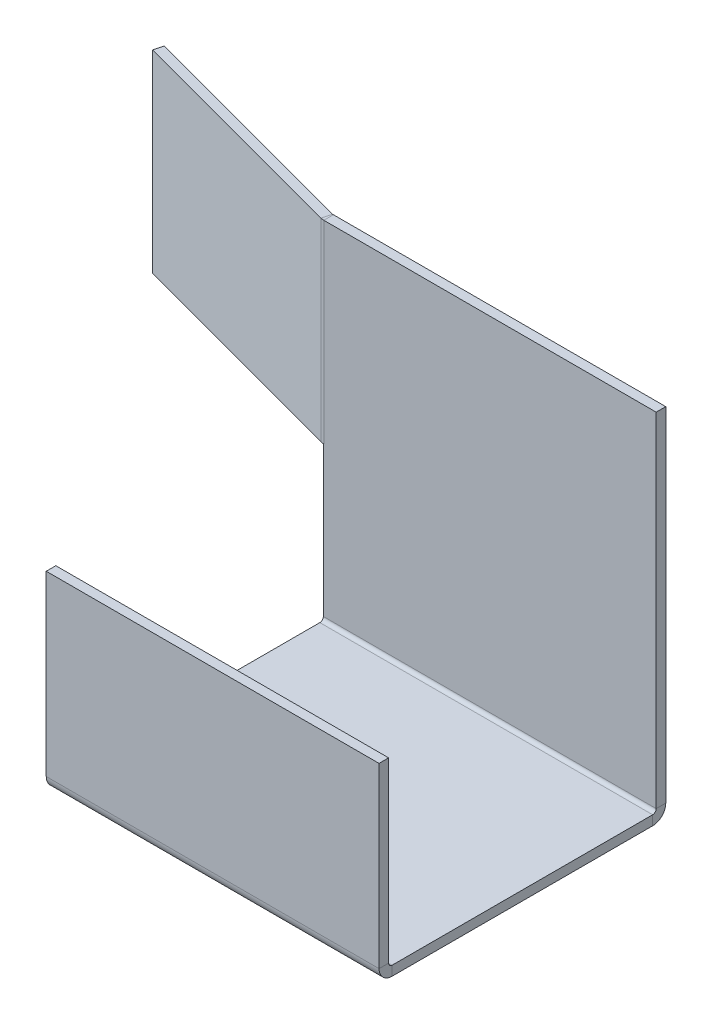
ISO-10303-21;
HEADER;
FILE_DESCRIPTION(('STEP AP214'),'2;1');
FILE_NAME('part.step','',(''),(''),'','','');
FILE_SCHEMA(('AUTOMOTIVE_DESIGN { 1 0 10303 214 1 1 1 1 }'));
ENDSEC;
DATA;
#1=APPLICATION_CONTEXT('core data for automotive mechanical design processes');
#2=APPLICATION_PROTOCOL_DEFINITION('international standard','automotive_design',2000,#1);
#3=PRODUCT_CONTEXT('',#1,'mechanical');
#4=PRODUCT('Part','Part','',(#3));
#5=PRODUCT_RELATED_PRODUCT_CATEGORY('part','',(#4));
#6=PRODUCT_DEFINITION_FORMATION('','',#4);
#7=PRODUCT_DEFINITION_CONTEXT('part definition',#1,'design');
#8=PRODUCT_DEFINITION('design','',#6,#7);
#9=PRODUCT_DEFINITION_SHAPE('','',#8);
#10=(LENGTH_UNIT() NAMED_UNIT(*) SI_UNIT(.MILLI.,.METRE.));
#11=(NAMED_UNIT(*) PLANE_ANGLE_UNIT() SI_UNIT($,.RADIAN.));
#12=(NAMED_UNIT(*) SI_UNIT($,.STERADIAN.) SOLID_ANGLE_UNIT());
#13=UNCERTAINTY_MEASURE_WITH_UNIT(LENGTH_MEASURE(1.E-05),#10,'distance_accuracy_value','');
#14=(GEOMETRIC_REPRESENTATION_CONTEXT(3) GLOBAL_UNCERTAINTY_ASSIGNED_CONTEXT((#13)) GLOBAL_UNIT_ASSIGNED_CONTEXT((#10,
#11,#12)) REPRESENTATION_CONTEXT('',''));
#15=CARTESIAN_POINT('',(0.,0.,0.));
#16=DIRECTION('',(0.,0.,1.));
#17=DIRECTION('',(1.,0.,0.));
#18=AXIS2_PLACEMENT_3D('',#15,#16,#17);
#19=CARTESIAN_POINT('',(0.,-2.,1.99999999999999));
#20=DIRECTION('',(1.,0.,0.));
#21=DIRECTION('',(0.,0.,-1.));
#22=AXIS2_PLACEMENT_3D('',#19,#20,#21);
#23=PLANE('',#22);
#24=DIRECTION('',(0.,-1.,0.));
#25=VECTOR('',#24,1.);
#26=CARTESIAN_POINT('',(0.,-1.94289029309402E-13,57.1));
#27=LINE('',#26,#25);
#28=CARTESIAN_POINT('',(0.,-1.94289029309402E-13,57.1));
#29=VERTEX_POINT('',#28);
#30=CARTESIAN_POINT('',(0.,-2.00000000000019,57.1));
#31=VERTEX_POINT('',#30);
#32=EDGE_CURVE('E228',#29,#31,#27,.T.);
#33=ORIENTED_EDGE('',*,*,#32,.F.);
#34=DIRECTION('',(0.,0.,-1.));
#35=VECTOR('',#34,1.);
#36=CARTESIAN_POINT('',(0.,0.,2.));
#37=LINE('',#36,#35);
#38=CARTESIAN_POINT('',(0.,0.,2.7366));
#39=VERTEX_POINT('',#38);
#40=EDGE_CURVE('E244',#29,#39,#37,.T.);
#41=ORIENTED_EDGE('',*,*,#40,.T.);
#42=DIRECTION('',(0.,-1.,0.));
#43=VECTOR('',#42,1.);
#44=CARTESIAN_POINT('',(0.,0.,2.7366));
#45=LINE('',#44,#43);
#46=CARTESIAN_POINT('',(0.,-2.,2.73659999999999));
#47=VERTEX_POINT('',#46);
#48=EDGE_CURVE('E231',#39,#47,#45,.T.);
#49=ORIENTED_EDGE('',*,*,#48,.T.);
#50=DIRECTION('',(0.,0.,-1.));
#51=VECTOR('',#50,1.);
#52=CARTESIAN_POINT('',(0.,-2.,1.99999999999999));
#53=LINE('',#52,#51);
#54=EDGE_CURVE('E245',#31,#47,#53,.T.);
#55=ORIENTED_EDGE('',*,*,#54,.F.);
#56=EDGE_LOOP('',(#33,#41,#49,#55));
#57=FACE_BOUND('',#56,.T.);
#58=ADVANCED_FACE('F37',(#57),#23,.F.);
#59=CARTESIAN_POINT('',(69.4601622410154,-2.0000000000002,57.8366));
#60=DIRECTION('',(-1.,0.,0.));
#61=DIRECTION('',(0.,0.,1.));
#62=AXIS2_PLACEMENT_3D('',#59,#60,#61);
#63=PLANE('',#62);
#64=DIRECTION('',(0.,-1.,0.));
#65=VECTOR('',#64,1.);
#66=CARTESIAN_POINT('',(69.4601622410154,-1.94289029309402E-13,57.1));
#67=LINE('',#66,#65);
#68=CARTESIAN_POINT('',(69.4601622410154,-1.92380621770257E-13,57.1));
#69=VERTEX_POINT('',#68);
#70=CARTESIAN_POINT('',(69.4601622410154,-2.00000000000019,57.1));
#71=VERTEX_POINT('',#70);
#72=EDGE_CURVE('E222',#69,#71,#67,.T.);
#73=ORIENTED_EDGE('',*,*,#72,.T.);
#74=DIRECTION('',(0.,0.,1.));
#75=VECTOR('',#74,1.);
#76=CARTESIAN_POINT('',(69.4601622410154,-2.0000000000002,57.8366));
#77=LINE('',#76,#75);
#78=CARTESIAN_POINT('',(69.4601622410154,-2.,2.73659999999999));
#79=VERTEX_POINT('',#78);
#80=EDGE_CURVE('E247',#79,#71,#77,.T.);
#81=ORIENTED_EDGE('',*,*,#80,.F.);
#82=DIRECTION('',(0.,-1.,0.));
#83=VECTOR('',#82,1.);
#84=CARTESIAN_POINT('',(69.4601622410154,0.,2.7366));
#85=LINE('',#84,#83);
#86=CARTESIAN_POINT('',(69.4601622410154,0.,2.7366));
#87=VERTEX_POINT('',#86);
#88=EDGE_CURVE('E236',#87,#79,#85,.T.);
#89=ORIENTED_EDGE('',*,*,#88,.F.);
#90=DIRECTION('',(0.,0.,1.));
#91=VECTOR('',#90,1.);
#92=CARTESIAN_POINT('',(69.4601622410154,-1.94952446924449E-13,57.8366));
#93=LINE('',#92,#91);
#94=EDGE_CURVE('E248',#87,#69,#93,.T.);
#95=ORIENTED_EDGE('',*,*,#94,.T.);
#96=EDGE_LOOP('',(#73,#81,#89,#95));
#97=FACE_BOUND('',#96,.T.);
#98=ADVANCED_FACE('F359',(#97),#63,.F.);
#99=CARTESIAN_POINT('',(0.,-1.99999999999999,0.));
#100=DIRECTION('',(0.,1.,0.));
#101=DIRECTION('',(0.,0.,1.));
#102=AXIS2_PLACEMENT_3D('',#99,#100,#101);
#103=PLANE('',#102);
#104=DIRECTION('',(1.,0.,0.));
#105=VECTOR('',#104,1.);
#106=CARTESIAN_POINT('',(69.4601622410154,-2.00000000000019,57.1));
#107=LINE('',#106,#105);
#108=EDGE_CURVE('E175',#71,#31,#107,.F.);
#109=ORIENTED_EDGE('',*,*,#108,.T.);
#110=ORIENTED_EDGE('',*,*,#54,.T.);
#111=DIRECTION('',(-1.,0.,0.));
#112=VECTOR('',#111,1.);
#113=CARTESIAN_POINT('',(0.,-2.,2.73659999999999));
#114=LINE('',#113,#112);
#115=EDGE_CURVE('E239',#79,#47,#114,.T.);
#116=ORIENTED_EDGE('',*,*,#115,.F.);
#117=ORIENTED_EDGE('',*,*,#80,.T.);
#118=EDGE_LOOP('',(#109,#110,#116,#117));
#119=FACE_BOUND('',#118,.T.);
#120=ADVANCED_FACE('F365',(#119),#103,.F.);
#121=CARTESIAN_POINT('',(0.,0.,0.));
#122=DIRECTION('',(0.,1.,0.));
#123=DIRECTION('',(0.,0.,1.));
#124=AXIS2_PLACEMENT_3D('',#121,#122,#123);
#125=PLANE('',#124);
#126=ORIENTED_EDGE('',*,*,#40,.F.);
#127=DIRECTION('',(1.,0.,0.));
#128=VECTOR('',#127,1.);
#129=CARTESIAN_POINT('',(69.4601622410154,-1.94289029309402E-13,57.1));
#130=LINE('',#129,#128);
#131=EDGE_CURVE('E55',#69,#29,#130,.F.);
#132=ORIENTED_EDGE('',*,*,#131,.F.);
#133=ORIENTED_EDGE('',*,*,#94,.F.);
#134=DIRECTION('',(1.,0.,0.));
#135=VECTOR('',#134,1.);
#136=CARTESIAN_POINT('',(0.,0.,2.7366));
#137=LINE('',#136,#135);
#138=EDGE_CURVE('E234',#39,#87,#137,.T.);
#139=ORIENTED_EDGE('',*,*,#138,.F.);
#140=EDGE_LOOP('',(#126,#132,#133,#139));
#141=FACE_BOUND('',#140,.T.);
#142=ADVANCED_FACE('F506',(#141),#125,.T.);
#143=CARTESIAN_POINT('',(0.,72.4,2.));
#144=DIRECTION('',(0.,0.,-1.));
#145=DIRECTION('',(-1.,0.,0.));
#146=AXIS2_PLACEMENT_3D('',#143,#144,#145);
#147=PLANE('',#146);
#148=DIRECTION('',(1.,0.,0.));
#149=VECTOR('',#148,1.);
#150=CARTESIAN_POINT('',(69.4601622410154,0.736599999999997,2.));
#151=LINE('',#150,#149);
#152=CARTESIAN_POINT('',(69.4601622410154,0.736599999999997,2.));
#153=VERTEX_POINT('',#152);
#154=CARTESIAN_POINT('',(0.,0.736599999999992,2.));
#155=VERTEX_POINT('',#154);
#156=EDGE_CURVE('E266',#153,#155,#151,.F.);
#157=ORIENTED_EDGE('',*,*,#156,.F.);
#158=DIRECTION('',(0.,-1.,0.));
#159=VECTOR('',#158,1.);
#160=CARTESIAN_POINT('',(69.4601622410154,72.4,2.));
#161=LINE('',#160,#159);
#162=CARTESIAN_POINT('',(69.4601622410154,72.4,2.));
#163=VERTEX_POINT('',#162);
#164=EDGE_CURVE('E11',#163,#153,#161,.T.);
#165=ORIENTED_EDGE('',*,*,#164,.F.);
#166=DIRECTION('',(1.,0.,0.));
#167=VECTOR('',#166,1.);
#168=CARTESIAN_POINT('',(0.,72.4,2.));
#169=LINE('',#168,#167);
#170=CARTESIAN_POINT('',(0.096975229722874,72.4,2.));
#171=VERTEX_POINT('',#170);
#172=EDGE_CURVE('E427',#171,#163,#169,.T.);
#173=ORIENTED_EDGE('',*,*,#172,.F.);
#174=DIRECTION('',(0.,1.,0.));
#175=VECTOR('',#174,1.);
#176=CARTESIAN_POINT('',(0.096975229722874,72.4,2.));
#177=LINE('',#176,#175);
#178=CARTESIAN_POINT('',(0.096975229722874,31.9536324054184,2.));
#179=VERTEX_POINT('',#178);
#180=EDGE_CURVE('E63',#171,#179,#177,.F.);
#181=ORIENTED_EDGE('',*,*,#180,.T.);
#182=CARTESIAN_POINT('',(0.096975229722874,31.9536324054184,2.));
#183=DIRECTION('',(-1.,0.,0.));
#184=VECTOR('',#183,1.);
#185=LINE('',#182,#184);
#186=CARTESIAN_POINT('',(1.54035814181158E-05,31.9536324054184,1.9991262973816));
#187=VERTEX_POINT('',#186);
#188=EDGE_CURVE('E317',#179,#187,#185,.T.);
#189=ORIENTED_EDGE('',*,*,#188,.T.);
#190=DIRECTION('',(0.,-1.,0.));
#191=VECTOR('',#190,1.);
#192=CARTESIAN_POINT('',(0.,72.4,2.));
#193=LINE('',#192,#191);
#194=EDGE_CURVE('E434',#187,#155,#193,.T.);
#195=ORIENTED_EDGE('',*,*,#194,.T.);
#196=EDGE_LOOP('',(#157,#165,#173,#181,#189,#195));
#197=FACE_BOUND('',#196,.T.);
#198=ADVANCED_FACE('F39',(#197),#147,.F.);
#199=CARTESIAN_POINT('',(0.,72.4,0.));
#200=DIRECTION('',(0.,0.,-1.));
#201=DIRECTION('',(-1.,0.,0.));
#202=AXIS2_PLACEMENT_3D('',#199,#200,#201);
#203=PLANE('',#202);
#204=DIRECTION('',(0.,-1.,0.));
#205=VECTOR('',#204,1.);
#206=CARTESIAN_POINT('',(69.4601622410154,72.4,0.));
#207=LINE('',#206,#205);
#208=CARTESIAN_POINT('',(69.4601622410154,72.4,0.));
#209=VERTEX_POINT('',#208);
#210=CARTESIAN_POINT('',(69.4601622410154,0.73659999999999,0.));
#211=VERTEX_POINT('',#210);
#212=EDGE_CURVE('E47',#209,#211,#207,.T.);
#213=ORIENTED_EDGE('',*,*,#212,.T.);
#214=DIRECTION('',(1.,0.,0.));
#215=VECTOR('',#214,1.);
#216=CARTESIAN_POINT('',(69.4601622410154,0.73659999999999,0.));
#217=LINE('',#216,#215);
#218=CARTESIAN_POINT('',(0.,0.736600000000006,0.));
#219=VERTEX_POINT('',#218);
#220=EDGE_CURVE('E253',#211,#219,#217,.F.);
#221=ORIENTED_EDGE('',*,*,#220,.T.);
#222=DIRECTION('',(0.,-1.,0.));
#223=VECTOR('',#222,1.);
#224=CARTESIAN_POINT('',(0.,72.4,0.));
#225=LINE('',#224,#223);
#226=CARTESIAN_POINT('',(0.,31.9536324054184,0.));
#227=VERTEX_POINT('',#226);
#228=EDGE_CURVE('E435',#227,#219,#225,.T.);
#229=ORIENTED_EDGE('',*,*,#228,.F.);
#230=DIRECTION('',(-1.,0.,0.));
#231=VECTOR('',#230,1.);
#232=CARTESIAN_POINT('',(0.096975229722874,31.9536324054184,0.));
#233=LINE('',#232,#231);
#234=CARTESIAN_POINT('',(0.096975229722874,31.9536324054184,0.));
#235=VERTEX_POINT('',#234);
#236=EDGE_CURVE('E316',#235,#227,#233,.T.);
#237=ORIENTED_EDGE('',*,*,#236,.F.);
#238=DIRECTION('',(0.,1.,0.));
#239=VECTOR('',#238,1.);
#240=CARTESIAN_POINT('',(0.096975229722874,72.4,0.));
#241=LINE('',#240,#239);
#242=CARTESIAN_POINT('',(0.096975229722874,72.4,0.));
#243=VERTEX_POINT('',#242);
#244=EDGE_CURVE('E309',#243,#235,#241,.F.);
#245=ORIENTED_EDGE('',*,*,#244,.F.);
#246=DIRECTION('',(1.,0.,0.));
#247=VECTOR('',#246,1.);
#248=CARTESIAN_POINT('',(0.,72.4,0.));
#249=LINE('',#248,#247);
#250=EDGE_CURVE('E432',#243,#209,#249,.T.);
#251=ORIENTED_EDGE('',*,*,#250,.T.);
#252=EDGE_LOOP('',(#213,#221,#229,#237,#245,#251));
#253=FACE_BOUND('',#252,.T.);
#254=ADVANCED_FACE('F351',(#253),#203,.T.);
#255=CARTESIAN_POINT('',(69.4601622410154,72.4,0.));
#256=DIRECTION('',(1.,0.,0.));
#257=DIRECTION('',(0.,0.,-1.));
#258=AXIS2_PLACEMENT_3D('',#255,#256,#257);
#259=PLANE('',#258);
#260=ORIENTED_EDGE('',*,*,#164,.T.);
#261=DIRECTION('',(0.,0.,-1.));
#262=VECTOR('',#261,1.);
#263=CARTESIAN_POINT('',(69.4601622410154,0.736599999999997,2.));
#264=LINE('',#263,#262);
#265=EDGE_CURVE('E260',#153,#211,#264,.T.);
#266=ORIENTED_EDGE('',*,*,#265,.T.);
#267=ORIENTED_EDGE('',*,*,#212,.F.);
#268=DIRECTION('',(0.,0.,1.));
#269=VECTOR('',#268,1.);
#270=CARTESIAN_POINT('',(69.4601622410154,72.4,0.));
#271=LINE('',#270,#269);
#272=EDGE_CURVE('E429',#209,#163,#271,.T.);
#273=ORIENTED_EDGE('',*,*,#272,.T.);
#274=EDGE_LOOP('',(#260,#266,#267,#273));
#275=FACE_BOUND('',#274,.T.);
#276=ADVANCED_FACE('F349',(#275),#259,.T.);
#277=CARTESIAN_POINT('',(0.,72.4,2.));
#278=DIRECTION('',(-1.,0.,0.));
#279=DIRECTION('',(0.,0.,1.));
#280=AXIS2_PLACEMENT_3D('',#277,#278,#279);
#281=PLANE('',#280);
#282=DIRECTION('',(0.,0.,-1.));
#283=VECTOR('',#282,1.);
#284=CARTESIAN_POINT('',(0.,0.736599999999992,2.));
#285=LINE('',#284,#283);
#286=EDGE_CURVE('E270',#155,#219,#285,.T.);
#287=ORIENTED_EDGE('',*,*,#286,.F.);
#288=ORIENTED_EDGE('',*,*,#194,.F.);
#289=DIRECTION('',(0.,0.,1.));
#290=VECTOR('',#289,1.);
#291=CARTESIAN_POINT('',(0.,31.9536324054184,0.));
#292=LINE('',#291,#290);
#293=EDGE_CURVE('E426',#227,#187,#292,.T.);
#294=ORIENTED_EDGE('',*,*,#293,.F.);
#295=ORIENTED_EDGE('',*,*,#228,.T.);
#296=EDGE_LOOP('',(#287,#288,#294,#295));
#297=FACE_BOUND('',#296,.T.);
#298=ADVANCED_FACE('F345',(#297),#281,.T.);
#299=CARTESIAN_POINT('',(0.,72.4,0.));
#300=DIRECTION('',(0.,-1.,0.));
#301=DIRECTION('',(-1.,0.,0.));
#302=AXIS2_PLACEMENT_3D('',#299,#300,#301);
#303=PLANE('',#302);
#304=DIRECTION('',(0.,0.,1.));
#305=VECTOR('',#304,1.);
#306=CARTESIAN_POINT('',(0.096975229722874,72.4,0.));
#307=LINE('',#306,#305);
#308=EDGE_CURVE('E314',#243,#171,#307,.T.);
#309=ORIENTED_EDGE('',*,*,#308,.T.);
#310=ORIENTED_EDGE('',*,*,#172,.T.);
#311=ORIENTED_EDGE('',*,*,#272,.F.);
#312=ORIENTED_EDGE('',*,*,#250,.F.);
#313=EDGE_LOOP('',(#309,#310,#311,#312));
#314=FACE_BOUND('',#313,.T.);
#315=ADVANCED_FACE('F335',(#314),#303,.F.);
#316=CARTESIAN_POINT('',(0.096975229722874,31.9536324054184,-0.736600000000002));
#317=DIRECTION('',(0.,-1.,0.));
#318=DIRECTION('',(0.,0.,-1.));
#319=AXIS2_PLACEMENT_3D('',#316,#317,#318);
#320=PLANE('',#319);
#321=ORIENTED_EDGE('',*,*,#236,.T.);
#322=ORIENTED_EDGE('',*,*,#293,.T.);
#323=CARTESIAN_POINT('',(0.096975229722874,31.9536324054184,2.));
#324=CARTESIAN_POINT('',(-0.263304995174785,31.9536324054184,2.));
#325=CARTESIAN_POINT('',(-0.611308969104669,31.9536324054184,1.90675261622267));
#326=B_SPLINE_CURVE_WITH_KNOTS('',2,(#323,#324,#325),.UNSPECIFIED.,.F.,.F.,(3,3),(0.,1.),.UNSPECIFIED.);
#327=CARTESIAN_POINT('',(-0.611308969104668,31.9536324054184,1.90675261622267));
#328=VERTEX_POINT('',#327);
#329=EDGE_CURVE('E423',#187,#328,#326,.T.);
#330=ORIENTED_EDGE('',*,*,#329,.T.);
#331=DIRECTION('',(-0.258819045102515,0.,0.96592582628907));
#332=VECTOR('',#331,1.);
#333=CARTESIAN_POINT('',(-0.0936708788996388,31.9536324054184,-0.0250990363554711));
#334=LINE('',#333,#332);
#335=CARTESIAN_POINT('',(-0.0936708788996391,31.9536324054184,-0.02509903635547));
#336=VERTEX_POINT('',#335);
#337=EDGE_CURVE('E273',#336,#328,#334,.T.);
#338=ORIENTED_EDGE('',*,*,#337,.F.);
#339=CARTESIAN_POINT('',(0.096975229722874,31.9536324054184,-0.736600000000002));
#340=DIRECTION('',(0.,1.,0.));
#341=DIRECTION('',(0.,0.,1.));
#342=AXIS2_PLACEMENT_3D('',#339,#340,#341);
#343=CIRCLE('',#342,0.736600000000003);
#344=EDGE_CURVE('E306',#235,#336,#343,.F.);
#345=ORIENTED_EDGE('',*,*,#344,.F.);
#346=EDGE_LOOP('',(#321,#322,#330,#338,#345));
#347=FACE_BOUND('',#346,.T.);
#348=ADVANCED_FACE('F324',(#347),#320,.T.);
#349=CARTESIAN_POINT('',(0.096975229722874,72.4,-0.736600000000002));
#350=DIRECTION('',(0.,-1.,0.));
#351=DIRECTION('',(0.,0.,-1.));
#352=AXIS2_PLACEMENT_3D('',#349,#350,#351);
#353=PLANE('',#352);
#354=CARTESIAN_POINT('',(0.096975229722874,72.4,-0.736600000000002));
#355=DIRECTION('',(0.,1.,0.));
#356=DIRECTION('',(0.,0.,1.));
#357=AXIS2_PLACEMENT_3D('',#354,#355,#356);
#358=CIRCLE('',#357,0.736600000000003);
#359=CARTESIAN_POINT('',(-0.0936708788996391,72.4,-0.02509903635547));
#360=VERTEX_POINT('',#359);
#361=EDGE_CURVE('E300',#360,#243,#358,.T.);
#362=ORIENTED_EDGE('',*,*,#361,.F.);
#363=DIRECTION('',(-0.258819045102515,0.,0.96592582628907));
#364=VECTOR('',#363,1.);
#365=CARTESIAN_POINT('',(-0.0936708788996388,72.4,-0.0250990363554711));
#366=LINE('',#365,#364);
#367=CARTESIAN_POINT('',(-0.611308969104668,72.4,1.90675261622267));
#368=VERTEX_POINT('',#367);
#369=EDGE_CURVE('E278',#360,#368,#366,.T.);
#370=ORIENTED_EDGE('',*,*,#369,.T.);
#371=CARTESIAN_POINT('',(0.096975229722874,72.4,-0.736600000000002));
#372=DIRECTION('',(0.,1.,0.));
#373=DIRECTION('',(0.,0.,1.));
#374=AXIS2_PLACEMENT_3D('',#371,#372,#373);
#375=CIRCLE('',#374,2.7366);
#376=EDGE_CURVE('E303',#368,#171,#375,.T.);
#377=ORIENTED_EDGE('',*,*,#376,.T.);
#378=ORIENTED_EDGE('',*,*,#308,.F.);
#379=EDGE_LOOP('',(#362,#370,#377,#378));
#380=FACE_BOUND('',#379,.T.);
#381=ADVANCED_FACE('F334',(#380),#353,.F.);
#382=CARTESIAN_POINT('',(0.096975229722874,72.4,-0.736600000000002));
#383=DIRECTION('',(0.,1.,0.));
#384=DIRECTION('',(-0.258819045102515,0.,0.96592582628907));
#385=AXIS2_PLACEMENT_3D('',#382,#383,#384);
#386=CYLINDRICAL_SURFACE('',#385,2.7366);
#387=ORIENTED_EDGE('',*,*,#180,.F.);
#388=ORIENTED_EDGE('',*,*,#376,.F.);
#389=DIRECTION('',(0.,1.,0.));
#390=VECTOR('',#389,1.);
#391=CARTESIAN_POINT('',(-0.611308969104668,0.,1.90675261622267));
#392=LINE('',#391,#390);
#393=EDGE_CURVE('E281',#328,#368,#392,.T.);
#394=ORIENTED_EDGE('',*,*,#393,.F.);
#395=ORIENTED_EDGE('',*,*,#329,.F.);
#396=ORIENTED_EDGE('',*,*,#188,.F.);
#397=EDGE_LOOP('',(#387,#388,#394,#395,#396));
#398=FACE_BOUND('',#397,.T.);
#399=ADVANCED_FACE('F341',(#398),#386,.T.);
#400=CARTESIAN_POINT('',(0.096975229722874,72.4,-0.736600000000002));
#401=DIRECTION('',(0.,1.,0.));
#402=DIRECTION('',(-0.258819045102515,0.,0.96592582628907));
#403=AXIS2_PLACEMENT_3D('',#400,#401,#402);
#404=CYLINDRICAL_SURFACE('',#403,0.736600000000003);
#405=ORIENTED_EDGE('',*,*,#244,.T.);
#406=ORIENTED_EDGE('',*,*,#344,.T.);
#407=DIRECTION('',(0.,1.,0.));
#408=VECTOR('',#407,1.);
#409=CARTESIAN_POINT('',(-0.0936708788996388,31.9536324054184,-0.0250990363554711));
#410=LINE('',#409,#408);
#411=EDGE_CURVE('E276',#336,#360,#410,.T.);
#412=ORIENTED_EDGE('',*,*,#411,.T.);
#413=ORIENTED_EDGE('',*,*,#361,.T.);
#414=EDGE_LOOP('',(#405,#406,#412,#413));
#415=FACE_BOUND('',#414,.T.);
#416=ADVANCED_FACE('F337',(#415),#404,.F.);
#417=CARTESIAN_POINT('',(-0.517638090205029,72.4,1.93185165257814));
#418=DIRECTION('',(0.,1.,0.));
#419=DIRECTION('',(0.,0.,1.));
#420=AXIS2_PLACEMENT_3D('',#417,#418,#419);
#421=PLANE('',#420);
#422=DIRECTION('',(0.96592582628907,0.,0.258819045102515));
#423=VECTOR('',#422,1.);
#424=CARTESIAN_POINT('',(-0.517638090205029,72.4,1.93185165257814));
#425=LINE('',#424,#423);
#426=CARTESIAN_POINT('',(-48.5489699618571,72.4,-10.938104933822));
#427=VERTEX_POINT('',#426);
#428=EDGE_CURVE('E285',#427,#368,#425,.T.);
#429=ORIENTED_EDGE('',*,*,#428,.T.);
#430=ORIENTED_EDGE('',*,*,#369,.F.);
#431=DIRECTION('',(0.96592582628907,0.,0.258819045102515));
#432=VECTOR('',#431,1.);
#433=CARTESIAN_POINT('',(0.,72.4,0.));
#434=LINE('',#433,#432);
#435=CARTESIAN_POINT('',(-48.0313318716521,72.4,-12.8699565864001));
#436=VERTEX_POINT('',#435);
#437=EDGE_CURVE('E295',#436,#360,#434,.T.);
#438=ORIENTED_EDGE('',*,*,#437,.F.);
#439=DIRECTION('',(0.258819045102515,0.,-0.96592582628907));
#440=VECTOR('',#439,1.);
#441=CARTESIAN_POINT('',(-48.5489699618571,72.4,-10.938104933822));
#442=LINE('',#441,#440);
#443=EDGE_CURVE('E298',#427,#436,#442,.T.);
#444=ORIENTED_EDGE('',*,*,#443,.F.);
#445=EDGE_LOOP('',(#429,#430,#438,#444));
#446=FACE_BOUND('',#445,.T.);
#447=ADVANCED_FACE('F397',(#446),#421,.T.);
#448=CARTESIAN_POINT('',(-48.5489699618571,31.9536324054184,-10.938104933822));
#449=DIRECTION('',(0.,-1.,0.));
#450=DIRECTION('',(0.,0.,-1.));
#451=AXIS2_PLACEMENT_3D('',#448,#449,#450);
#452=PLANE('',#451);
#453=DIRECTION('',(-0.96592582628907,0.,-0.258819045102515));
#454=VECTOR('',#453,1.);
#455=CARTESIAN_POINT('',(-48.0313318716521,31.9536324054184,-12.8699565864001));
#456=LINE('',#455,#454);
#457=CARTESIAN_POINT('',(-48.0313318716521,31.9536324054184,-12.8699565864001));
#458=VERTEX_POINT('',#457);
#459=EDGE_CURVE('E290',#336,#458,#456,.T.);
#460=ORIENTED_EDGE('',*,*,#459,.F.);
#461=ORIENTED_EDGE('',*,*,#337,.T.);
#462=DIRECTION('',(-0.96592582628907,0.,-0.258819045102515));
#463=VECTOR('',#462,1.);
#464=CARTESIAN_POINT('',(-48.5489699618571,31.9536324054184,-10.938104933822));
#465=LINE('',#464,#463);
#466=CARTESIAN_POINT('',(-48.5489699618571,31.9536324054184,-10.938104933822));
#467=VERTEX_POINT('',#466);
#468=EDGE_CURVE('E286',#328,#467,#465,.T.);
#469=ORIENTED_EDGE('',*,*,#468,.T.);
#470=DIRECTION('',(0.258819045102515,0.,-0.96592582628907));
#471=VECTOR('',#470,1.);
#472=CARTESIAN_POINT('',(-48.5489699618571,31.9536324054184,-10.938104933822));
#473=LINE('',#472,#471);
#474=EDGE_CURVE('E289',#467,#458,#473,.T.);
#475=ORIENTED_EDGE('',*,*,#474,.T.);
#476=EDGE_LOOP('',(#460,#461,#469,#475));
#477=FACE_BOUND('',#476,.T.);
#478=ADVANCED_FACE('F392',(#477),#452,.T.);
#479=CARTESIAN_POINT('',(-0.517638090205029,0.,1.93185165257814));
#480=DIRECTION('',(-0.258819045102515,0.,0.96592582628907));
#481=DIRECTION('',(0.96592582628907,0.,0.258819045102515));
#482=AXIS2_PLACEMENT_3D('',#479,#480,#481);
#483=PLANE('',#482);
#484=ORIENTED_EDGE('',*,*,#468,.F.);
#485=ORIENTED_EDGE('',*,*,#393,.T.);
#486=ORIENTED_EDGE('',*,*,#428,.F.);
#487=DIRECTION('',(0.,1.,0.));
#488=VECTOR('',#487,1.);
#489=CARTESIAN_POINT('',(-48.5489699618571,72.4,-10.938104933822));
#490=LINE('',#489,#488);
#491=EDGE_CURVE('E282',#467,#427,#490,.T.);
#492=ORIENTED_EDGE('',*,*,#491,.F.);
#493=EDGE_LOOP('',(#484,#485,#486,#492));
#494=FACE_BOUND('',#493,.T.);
#495=ADVANCED_FACE('F388',(#494),#483,.T.);
#496=CARTESIAN_POINT('',(0.,0.,0.));
#497=DIRECTION('',(-0.258819045102515,0.,0.96592582628907));
#498=DIRECTION('',(0.96592582628907,0.,0.258819045102515));
#499=AXIS2_PLACEMENT_3D('',#496,#497,#498);
#500=PLANE('',#499);
#501=ORIENTED_EDGE('',*,*,#411,.F.);
#502=ORIENTED_EDGE('',*,*,#459,.T.);
#503=DIRECTION('',(0.,1.,0.));
#504=VECTOR('',#503,1.);
#505=CARTESIAN_POINT('',(-48.0313318716521,72.4,-12.8699565864001));
#506=LINE('',#505,#504);
#507=EDGE_CURVE('E292',#458,#436,#506,.T.);
#508=ORIENTED_EDGE('',*,*,#507,.T.);
#509=ORIENTED_EDGE('',*,*,#437,.T.);
#510=EDGE_LOOP('',(#501,#502,#508,#509));
#511=FACE_BOUND('',#510,.T.);
#512=ADVANCED_FACE('F391',(#511),#500,.F.);
#513=CARTESIAN_POINT('',(-48.5489699618571,72.4,-10.938104933822));
#514=DIRECTION('',(-0.96592582628907,0.,-0.258819045102515));
#515=DIRECTION('',(-0.258819045102515,0.,0.96592582628907));
#516=AXIS2_PLACEMENT_3D('',#513,#514,#515);
#517=PLANE('',#516);
#518=ORIENTED_EDGE('',*,*,#507,.F.);
#519=ORIENTED_EDGE('',*,*,#474,.F.);
#520=ORIENTED_EDGE('',*,*,#491,.T.);
#521=ORIENTED_EDGE('',*,*,#443,.T.);
#522=EDGE_LOOP('',(#518,#519,#520,#521));
#523=FACE_BOUND('',#522,.T.);
#524=ADVANCED_FACE('F383',(#523),#517,.T.);
#525=CARTESIAN_POINT('',(0.,0.736599999999995,2.7366));
#526=DIRECTION('',(-1.,0.,0.));
#527=DIRECTION('',(0.,-1.,0.));
#528=AXIS2_PLACEMENT_3D('',#525,#526,#527);
#529=PLANE('',#528);
#530=ORIENTED_EDGE('',*,*,#48,.F.);
#531=CARTESIAN_POINT('',(0.,0.736599999999995,2.7366));
#532=DIRECTION('',(1.,0.,0.));
#533=DIRECTION('',(0.,1.,0.));
#534=AXIS2_PLACEMENT_3D('',#531,#532,#533);
#535=CIRCLE('',#534,0.736599999999997);
#536=EDGE_CURVE('E263',#155,#39,#535,.F.);
#537=ORIENTED_EDGE('',*,*,#536,.F.);
#538=ORIENTED_EDGE('',*,*,#286,.T.);
#539=CARTESIAN_POINT('',(0.,0.736599999999995,2.7366));
#540=DIRECTION('',(1.,0.,0.));
#541=DIRECTION('',(0.,1.,0.));
#542=AXIS2_PLACEMENT_3D('',#539,#540,#541);
#543=CIRCLE('',#542,2.7366);
#544=EDGE_CURVE('E256',#219,#47,#543,.F.);
#545=ORIENTED_EDGE('',*,*,#544,.T.);
#546=EDGE_LOOP('',(#530,#537,#538,#545));
#547=FACE_BOUND('',#546,.T.);
#548=ADVANCED_FACE('F380',(#547),#529,.T.);
#549=CARTESIAN_POINT('',(69.4601622410154,0.7366,2.7366));
#550=DIRECTION('',(-1.,0.,0.));
#551=DIRECTION('',(0.,-1.,0.));
#552=AXIS2_PLACEMENT_3D('',#549,#550,#551);
#553=PLANE('',#552);
#554=CARTESIAN_POINT('',(69.4601622410154,0.7366,2.7366));
#555=DIRECTION('',(1.,0.,0.));
#556=DIRECTION('',(0.,1.,0.));
#557=AXIS2_PLACEMENT_3D('',#554,#555,#556);
#558=CIRCLE('',#557,0.736599999999997);
#559=EDGE_CURVE('E250',#87,#153,#558,.T.);
#560=ORIENTED_EDGE('',*,*,#559,.F.);
#561=ORIENTED_EDGE('',*,*,#88,.T.);
#562=CARTESIAN_POINT('',(69.4601622410154,0.7366,2.7366));
#563=DIRECTION('',(1.,0.,0.));
#564=DIRECTION('',(0.,1.,0.));
#565=AXIS2_PLACEMENT_3D('',#562,#563,#564);
#566=CIRCLE('',#565,2.7366);
#567=EDGE_CURVE('E257',#79,#211,#566,.T.);
#568=ORIENTED_EDGE('',*,*,#567,.T.);
#569=ORIENTED_EDGE('',*,*,#265,.F.);
#570=EDGE_LOOP('',(#560,#561,#568,#569));
#571=FACE_BOUND('',#570,.T.);
#572=ADVANCED_FACE('F374',(#571),#553,.F.);
#573=CARTESIAN_POINT('',(69.4601622410154,0.7366,2.7366));
#574=DIRECTION('',(1.,0.,0.));
#575=DIRECTION('',(0.,-1.,0.));
#576=AXIS2_PLACEMENT_3D('',#573,#574,#575);
#577=CYLINDRICAL_SURFACE('',#576,2.7366);
#578=ORIENTED_EDGE('',*,*,#220,.F.);
#579=ORIENTED_EDGE('',*,*,#567,.F.);
#580=ORIENTED_EDGE('',*,*,#115,.T.);
#581=ORIENTED_EDGE('',*,*,#544,.F.);
#582=EDGE_LOOP('',(#578,#579,#580,#581));
#583=FACE_BOUND('',#582,.T.);
#584=ADVANCED_FACE('F370',(#583),#577,.T.);
#585=CARTESIAN_POINT('',(69.4601622410154,0.7366,2.7366));
#586=DIRECTION('',(1.,0.,0.));
#587=DIRECTION('',(0.,-1.,0.));
#588=AXIS2_PLACEMENT_3D('',#585,#586,#587);
#589=CYLINDRICAL_SURFACE('',#588,0.736599999999997);
#590=ORIENTED_EDGE('',*,*,#156,.T.);
#591=ORIENTED_EDGE('',*,*,#536,.T.);
#592=ORIENTED_EDGE('',*,*,#138,.T.);
#593=ORIENTED_EDGE('',*,*,#559,.T.);
#594=EDGE_LOOP('',(#590,#591,#592,#593));
#595=FACE_BOUND('',#594,.T.);
#596=ADVANCED_FACE('F373',(#595),#589,.F.);
#597=CARTESIAN_POINT('',(0.,0.736599999999803,57.1));
#598=DIRECTION('',(-1.,0.,0.));
#599=DIRECTION('',(0.,0.,1.));
#600=AXIS2_PLACEMENT_3D('',#597,#598,#599);
#601=PLANE('',#600);
#602=DIRECTION('',(0.,0.,1.));
#603=VECTOR('',#602,1.);
#604=CARTESIAN_POINT('',(0.,0.736599999999803,57.8366));
#605=LINE('',#604,#603);
#606=CARTESIAN_POINT('',(0.,0.736599999999803,57.8366));
#607=VERTEX_POINT('',#606);
#608=CARTESIAN_POINT('',(0.,0.736599999999803,59.8366));
#609=VERTEX_POINT('',#608);
#610=EDGE_CURVE('E498',#607,#609,#605,.T.);
#611=ORIENTED_EDGE('',*,*,#610,.F.);
#612=CARTESIAN_POINT('',(0.,0.736599999999803,57.1));
#613=DIRECTION('',(1.,0.,0.));
#614=DIRECTION('',(0.,0.,-1.));
#615=AXIS2_PLACEMENT_3D('',#612,#613,#614);
#616=CIRCLE('',#615,0.736599999999997);
#617=EDGE_CURVE('E178',#29,#607,#616,.F.);
#618=ORIENTED_EDGE('',*,*,#617,.F.);
#619=ORIENTED_EDGE('',*,*,#32,.T.);
#620=CARTESIAN_POINT('',(0.,0.736599999999803,57.1));
#621=DIRECTION('',(1.,0.,0.));
#622=DIRECTION('',(0.,0.,-1.));
#623=AXIS2_PLACEMENT_3D('',#620,#621,#622);
#624=CIRCLE('',#623,2.7366);
#625=EDGE_CURVE('E221',#31,#609,#624,.F.);
#626=ORIENTED_EDGE('',*,*,#625,.T.);
#627=EDGE_LOOP('',(#611,#618,#619,#626));
#628=FACE_BOUND('',#627,.T.);
#629=ADVANCED_FACE('F378',(#628),#601,.T.);
#630=CARTESIAN_POINT('',(69.4601622410154,0.736599999999803,57.1));
#631=DIRECTION('',(-1.,0.,0.));
#632=DIRECTION('',(0.,0.,1.));
#633=AXIS2_PLACEMENT_3D('',#630,#631,#632);
#634=PLANE('',#633);
#635=CARTESIAN_POINT('',(69.4601622410154,0.736599999999803,57.1));
#636=DIRECTION('',(1.,0.,0.));
#637=DIRECTION('',(0.,0.,-1.));
#638=AXIS2_PLACEMENT_3D('',#635,#636,#637);
#639=CIRCLE('',#638,0.736599999999997);
#640=CARTESIAN_POINT('',(69.4601622410154,0.736599999999803,57.8366));
#641=VERTEX_POINT('',#640);
#642=EDGE_CURVE('E185',#641,#69,#639,.T.);
#643=ORIENTED_EDGE('',*,*,#642,.F.);
#644=DIRECTION('',(0.,0.,1.));
#645=VECTOR('',#644,1.);
#646=CARTESIAN_POINT('',(69.4601622410154,0.736599999999803,57.8366));
#647=LINE('',#646,#645);
#648=CARTESIAN_POINT('',(69.4601622410154,0.736599999999803,59.8366));
#649=VERTEX_POINT('',#648);
#650=EDGE_CURVE('E182',#641,#649,#647,.T.);
#651=ORIENTED_EDGE('',*,*,#650,.T.);
#652=CARTESIAN_POINT('',(69.4601622410154,0.736599999999803,57.1));
#653=DIRECTION('',(1.,0.,0.));
#654=DIRECTION('',(0.,0.,-1.));
#655=AXIS2_PLACEMENT_3D('',#652,#653,#654);
#656=CIRCLE('',#655,2.7366);
#657=EDGE_CURVE('E168',#649,#71,#656,.T.);
#658=ORIENTED_EDGE('',*,*,#657,.T.);
#659=ORIENTED_EDGE('',*,*,#72,.F.);
#660=EDGE_LOOP('',(#643,#651,#658,#659));
#661=FACE_BOUND('',#660,.T.);
#662=ADVANCED_FACE('F183',(#661),#634,.F.);
#663=CARTESIAN_POINT('',(69.4601622410154,0.736599999999803,57.1));
#664=DIRECTION('',(1.,0.,0.));
#665=DIRECTION('',(0.,0.,1.));
#666=AXIS2_PLACEMENT_3D('',#663,#664,#665);
#667=CYLINDRICAL_SURFACE('',#666,2.7366);
#668=ORIENTED_EDGE('',*,*,#108,.F.);
#669=ORIENTED_EDGE('',*,*,#657,.F.);
#670=DIRECTION('',(-1.,0.,0.));
#671=VECTOR('',#670,1.);
#672=CARTESIAN_POINT('',(0.,0.736599999999803,59.8366));
#673=LINE('',#672,#671);
#674=EDGE_CURVE('E173',#649,#609,#673,.T.);
#675=ORIENTED_EDGE('',*,*,#674,.T.);
#676=ORIENTED_EDGE('',*,*,#625,.F.);
#677=EDGE_LOOP('',(#668,#669,#675,#676));
#678=FACE_BOUND('',#677,.T.);
#679=ADVANCED_FACE('F170',(#678),#667,.T.);
#680=CARTESIAN_POINT('',(69.4601622410154,0.736599999999803,57.1));
#681=DIRECTION('',(1.,0.,0.));
#682=DIRECTION('',(0.,0.,1.));
#683=AXIS2_PLACEMENT_3D('',#680,#681,#682);
#684=CYLINDRICAL_SURFACE('',#683,0.736599999999997);
#685=ORIENTED_EDGE('',*,*,#131,.T.);
#686=ORIENTED_EDGE('',*,*,#617,.T.);
#687=DIRECTION('',(1.,0.,0.));
#688=VECTOR('',#687,1.);
#689=CARTESIAN_POINT('',(0.,0.736599999999803,57.8366));
#690=LINE('',#689,#688);
#691=EDGE_CURVE('E189',#607,#641,#690,.T.);
#692=ORIENTED_EDGE('',*,*,#691,.T.);
#693=ORIENTED_EDGE('',*,*,#642,.T.);
#694=EDGE_LOOP('',(#685,#686,#692,#693));
#695=FACE_BOUND('',#694,.T.);
#696=ADVANCED_FACE('F493',(#695),#684,.F.);
#697=CARTESIAN_POINT('',(69.4601622410154,37.8365999999998,59.8366));
#698=DIRECTION('',(-1.,0.,0.));
#699=DIRECTION('',(0.,0.,1.));
#700=AXIS2_PLACEMENT_3D('',#697,#698,#699);
#701=PLANE('',#700);
#702=ORIENTED_EDGE('',*,*,#650,.F.);
#703=DIRECTION('',(0.,1.,0.));
#704=VECTOR('',#703,1.);
#705=CARTESIAN_POINT('',(69.4601622410154,37.8365999999998,57.8366));
#706=LINE('',#705,#704);
#707=CARTESIAN_POINT('',(69.4601622410154,37.8365999999998,57.8366));
#708=VERTEX_POINT('',#707);
#709=EDGE_CURVE('E198',#641,#708,#706,.T.);
#710=ORIENTED_EDGE('',*,*,#709,.T.);
#711=DIRECTION('',(0.,0.,-1.));
#712=VECTOR('',#711,1.);
#713=CARTESIAN_POINT('',(69.4601622410154,37.8365999999998,59.8366));
#714=LINE('',#713,#712);
#715=CARTESIAN_POINT('',(69.4601622410154,37.8365999999998,59.8366));
#716=VERTEX_POINT('',#715);
#717=EDGE_CURVE('E203',#716,#708,#714,.T.);
#718=ORIENTED_EDGE('',*,*,#717,.F.);
#719=DIRECTION('',(0.,1.,0.));
#720=VECTOR('',#719,1.);
#721=CARTESIAN_POINT('',(69.4601622410154,37.8365999999998,59.8366));
#722=LINE('',#721,#720);
#723=EDGE_CURVE('E194',#649,#716,#722,.T.);
#724=ORIENTED_EDGE('',*,*,#723,.F.);
#725=EDGE_LOOP('',(#702,#710,#718,#724));
#726=FACE_BOUND('',#725,.T.);
#727=ADVANCED_FACE('F201',(#726),#701,.F.);
#728=CARTESIAN_POINT('',(0.,-1.94952446924449E-13,59.8366));
#729=DIRECTION('',(1.,0.,0.));
#730=DIRECTION('',(0.,0.,-1.));
#731=AXIS2_PLACEMENT_3D('',#728,#729,#730);
#732=PLANE('',#731);
#733=ORIENTED_EDGE('',*,*,#610,.T.);
#734=DIRECTION('',(0.,-1.,0.));
#735=VECTOR('',#734,1.);
#736=CARTESIAN_POINT('',(0.,-1.94952446924449E-13,59.8366));
#737=LINE('',#736,#735);
#738=CARTESIAN_POINT('',(0.,37.8365999999998,59.8366));
#739=VERTEX_POINT('',#738);
#740=EDGE_CURVE('E197',#739,#609,#737,.T.);
#741=ORIENTED_EDGE('',*,*,#740,.F.);
#742=DIRECTION('',(0.,0.,-1.));
#743=VECTOR('',#742,1.);
#744=CARTESIAN_POINT('',(0.,37.8365999999998,59.8366));
#745=LINE('',#744,#743);
#746=CARTESIAN_POINT('',(0.,37.8365999999998,57.8366));
#747=VERTEX_POINT('',#746);
#748=EDGE_CURVE('E214',#739,#747,#745,.T.);
#749=ORIENTED_EDGE('',*,*,#748,.T.);
#750=DIRECTION('',(0.,-1.,0.));
#751=VECTOR('',#750,1.);
#752=CARTESIAN_POINT('',(0.,-1.94952446924449E-13,57.8366));
#753=LINE('',#752,#751);
#754=EDGE_CURVE('E205',#747,#607,#753,.T.);
#755=ORIENTED_EDGE('',*,*,#754,.T.);
#756=EDGE_LOOP('',(#733,#741,#749,#755));
#757=FACE_BOUND('',#756,.T.);
#758=ADVANCED_FACE('F502',(#757),#732,.F.);
#759=CARTESIAN_POINT('',(0.,0.,59.8366));
#760=DIRECTION('',(0.,0.,-1.));
#761=DIRECTION('',(-1.,0.,0.));
#762=AXIS2_PLACEMENT_3D('',#759,#760,#761);
#763=PLANE('',#762);
#764=ORIENTED_EDGE('',*,*,#674,.F.);
#765=ORIENTED_EDGE('',*,*,#723,.T.);
#766=DIRECTION('',(-1.,0.,0.));
#767=VECTOR('',#766,1.);
#768=CARTESIAN_POINT('',(0.,37.8365999999998,59.8366));
#769=LINE('',#768,#767);
#770=EDGE_CURVE('E204',#716,#739,#769,.T.);
#771=ORIENTED_EDGE('',*,*,#770,.T.);
#772=ORIENTED_EDGE('',*,*,#740,.T.);
#773=EDGE_LOOP('',(#764,#765,#771,#772));
#774=FACE_BOUND('',#773,.T.);
#775=ADVANCED_FACE('F193',(#774),#763,.F.);
#776=CARTESIAN_POINT('',(0.,0.,57.8366));
#777=DIRECTION('',(0.,0.,-1.));
#778=DIRECTION('',(-1.,0.,0.));
#779=AXIS2_PLACEMENT_3D('',#776,#777,#778);
#780=PLANE('',#779);
#781=ORIENTED_EDGE('',*,*,#709,.F.);
#782=ORIENTED_EDGE('',*,*,#691,.F.);
#783=ORIENTED_EDGE('',*,*,#754,.F.);
#784=DIRECTION('',(-1.,0.,0.));
#785=VECTOR('',#784,1.);
#786=CARTESIAN_POINT('',(0.,37.8365999999998,57.8366));
#787=LINE('',#786,#785);
#788=EDGE_CURVE('E209',#708,#747,#787,.T.);
#789=ORIENTED_EDGE('',*,*,#788,.F.);
#790=EDGE_LOOP('',(#781,#782,#783,#789));
#791=FACE_BOUND('',#790,.T.);
#792=ADVANCED_FACE('F527',(#791),#780,.T.);
#793=CARTESIAN_POINT('',(0.,37.8365999999998,59.8366));
#794=DIRECTION('',(0.,-1.,0.));
#795=DIRECTION('',(0.,0.,-1.));
#796=AXIS2_PLACEMENT_3D('',#793,#794,#795);
#797=PLANE('',#796);
#798=ORIENTED_EDGE('',*,*,#788,.T.);
#799=ORIENTED_EDGE('',*,*,#748,.F.);
#800=ORIENTED_EDGE('',*,*,#770,.F.);
#801=ORIENTED_EDGE('',*,*,#717,.T.);
#802=EDGE_LOOP('',(#798,#799,#800,#801));
#803=FACE_BOUND('',#802,.T.);
#804=ADVANCED_FACE('F524',(#803),#797,.F.);
#805=CLOSED_SHELL('',(#58,#98,#120,#142,#198,#254,#276,#298,#315,#348,#381,#399,#416,#447,#478,
#495,#512,#524,#548,#572,#584,#596,#629,#662,#679,#696,#727,#758,#775,#792,#804));
#806=MANIFOLD_SOLID_BREP('B2',#805);
#807=ADVANCED_BREP_SHAPE_REPRESENTATION('',(#18,#806),#14);
#808=SHAPE_DEFINITION_REPRESENTATION(#9,#807);
ENDSEC;
END-ISO-10303-21;
